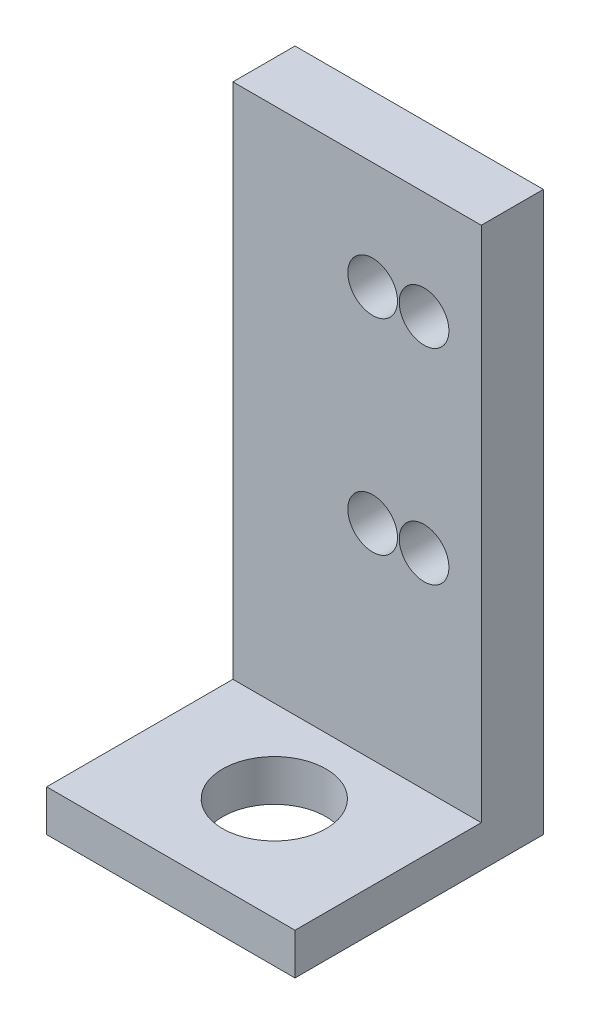
ISO-10303-21;
HEADER;
FILE_DESCRIPTION(('STEP AP214'),'2;1');
FILE_NAME('part.step','',(''),(''),'','','');
FILE_SCHEMA(('AUTOMOTIVE_DESIGN { 1 0 10303 214 1 1 1 1 }'));
ENDSEC;
DATA;
#1=APPLICATION_CONTEXT('core data for automotive mechanical design processes');
#2=APPLICATION_PROTOCOL_DEFINITION('international standard','automotive_design',2000,#1);
#3=PRODUCT_CONTEXT('',#1,'mechanical');
#4=PRODUCT('Part','Part','',(#3));
#5=PRODUCT_RELATED_PRODUCT_CATEGORY('part','',(#4));
#6=PRODUCT_DEFINITION_FORMATION('','',#4);
#7=PRODUCT_DEFINITION_CONTEXT('part definition',#1,'design');
#8=PRODUCT_DEFINITION('design','',#6,#7);
#9=PRODUCT_DEFINITION_SHAPE('','',#8);
#10=(LENGTH_UNIT() NAMED_UNIT(*) SI_UNIT(.MILLI.,.METRE.));
#11=(NAMED_UNIT(*) PLANE_ANGLE_UNIT() SI_UNIT($,.RADIAN.));
#12=(NAMED_UNIT(*) SI_UNIT($,.STERADIAN.) SOLID_ANGLE_UNIT());
#13=UNCERTAINTY_MEASURE_WITH_UNIT(LENGTH_MEASURE(1.E-05),#10,'distance_accuracy_value','');
#14=(GEOMETRIC_REPRESENTATION_CONTEXT(3) GLOBAL_UNCERTAINTY_ASSIGNED_CONTEXT((#13)) GLOBAL_UNIT_ASSIGNED_CONTEXT((#10,
#11,#12)) REPRESENTATION_CONTEXT('',''));
#15=CARTESIAN_POINT('',(0.,0.,0.));
#16=DIRECTION('',(0.,0.,1.));
#17=DIRECTION('',(1.,0.,0.));
#18=AXIS2_PLACEMENT_3D('',#15,#16,#17);
#19=CARTESIAN_POINT('',(0.,0.,3.));
#20=DIRECTION('',(0.,0.,-1.));
#21=DIRECTION('',(-1.,0.,0.));
#22=AXIS2_PLACEMENT_3D('',#19,#20,#21);
#23=PLANE('',#22);
#24=CARTESIAN_POINT('',(6.75218231571925,11.8999999999979,3.));
#25=DIRECTION('',(0.,0.,1.));
#26=DIRECTION('',(1.,0.,0.));
#27=AXIS2_PLACEMENT_3D('',#24,#25,#26);
#28=CIRCLE('',#27,1.2);
#29=CARTESIAN_POINT('',(7.95218231571925,11.8999999999979,3.));
#30=VERTEX_POINT('',#29);
#31=EDGE_CURVE('E137',#30,#30,#28,.T.);
#32=ORIENTED_EDGE('',*,*,#31,.F.);
#33=EDGE_LOOP('',(#32));
#34=FACE_BOUND('',#33,.T.);
#35=CARTESIAN_POINT('',(6.75218231571925,21.7999999999979,3.));
#36=DIRECTION('',(0.,0.,1.));
#37=DIRECTION('',(1.,0.,0.));
#38=AXIS2_PLACEMENT_3D('',#35,#36,#37);
#39=CIRCLE('',#38,1.2);
#40=CARTESIAN_POINT('',(7.95218231571925,21.7999999999979,3.));
#41=VERTEX_POINT('',#40);
#42=EDGE_CURVE('E145',#41,#41,#39,.T.);
#43=ORIENTED_EDGE('',*,*,#42,.F.);
#44=EDGE_LOOP('',(#43));
#45=FACE_BOUND('',#44,.T.);
#46=CARTESIAN_POINT('',(9.23614126060771,11.8999999999912,3.));
#47=DIRECTION('',(0.,0.,1.));
#48=DIRECTION('',(1.,0.,0.));
#49=AXIS2_PLACEMENT_3D('',#46,#47,#48);
#50=CIRCLE('',#49,1.2);
#51=CARTESIAN_POINT('',(10.4361412606077,11.8999999999912,3.));
#52=VERTEX_POINT('',#51);
#53=EDGE_CURVE('E130',#52,#52,#50,.T.);
#54=ORIENTED_EDGE('',*,*,#53,.F.);
#55=EDGE_LOOP('',(#54));
#56=FACE_BOUND('',#55,.T.);
#57=CARTESIAN_POINT('',(9.23614126060771,21.7999999999912,3.));
#58=DIRECTION('',(0.,0.,1.));
#59=DIRECTION('',(1.,0.,0.));
#60=AXIS2_PLACEMENT_3D('',#57,#58,#59);
#61=CIRCLE('',#60,1.2);
#62=CARTESIAN_POINT('',(10.4361412606077,21.7999999999912,3.));
#63=VERTEX_POINT('',#62);
#64=EDGE_CURVE('E143',#63,#63,#61,.T.);
#65=ORIENTED_EDGE('',*,*,#64,.F.);
#66=EDGE_LOOP('',(#65));
#67=FACE_BOUND('',#66,.T.);
#68=DIRECTION('',(-1.,0.,0.));
#69=VECTOR('',#68,1.);
#70=CARTESIAN_POINT('',(0.,2.,3.));
#71=LINE('',#70,#69);
#72=CARTESIAN_POINT('',(12.,2.,3.));
#73=VERTEX_POINT('',#72);
#74=CARTESIAN_POINT('',(0.,2.,3.));
#75=VERTEX_POINT('',#74);
#76=EDGE_CURVE('E58',#73,#75,#71,.T.);
#77=ORIENTED_EDGE('',*,*,#76,.F.);
#78=DIRECTION('',(0.,1.,0.));
#79=VECTOR('',#78,1.);
#80=CARTESIAN_POINT('',(12.,0.,3.));
#81=LINE('',#80,#79);
#82=CARTESIAN_POINT('',(12.,27.,3.));
#83=VERTEX_POINT('',#82);
#84=EDGE_CURVE('E187',#73,#83,#81,.T.);
#85=ORIENTED_EDGE('',*,*,#84,.T.);
#86=DIRECTION('',(-1.,0.,0.));
#87=VECTOR('',#86,1.);
#88=CARTESIAN_POINT('',(0.,27.,3.));
#89=LINE('',#88,#87);
#90=CARTESIAN_POINT('',(0.,27.,3.));
#91=VERTEX_POINT('',#90);
#92=EDGE_CURVE('E64',#83,#91,#89,.T.);
#93=ORIENTED_EDGE('',*,*,#92,.T.);
#94=DIRECTION('',(0.,-1.,0.));
#95=VECTOR('',#94,1.);
#96=CARTESIAN_POINT('',(0.,0.,3.));
#97=LINE('',#96,#95);
#98=EDGE_CURVE('E94',#91,#75,#97,.T.);
#99=ORIENTED_EDGE('',*,*,#98,.T.);
#100=EDGE_LOOP('',(#77,#85,#93,#99));
#101=FACE_BOUND('',#100,.T.);
#102=ADVANCED_FACE('F40',(#34,#45,#56,#67,#101),#23,.F.);
#103=CARTESIAN_POINT('',(0.,0.,3.));
#104=DIRECTION('',(1.,0.,0.));
#105=DIRECTION('',(0.,0.,-1.));
#106=AXIS2_PLACEMENT_3D('',#103,#104,#105);
#107=PLANE('',#106);
#108=DIRECTION('',(0.,-1.,0.));
#109=VECTOR('',#108,1.);
#110=CARTESIAN_POINT('',(0.,0.,0.));
#111=LINE('',#110,#109);
#112=CARTESIAN_POINT('',(0.,27.,0.));
#113=VERTEX_POINT('',#112);
#114=CARTESIAN_POINT('',(0.,0.,0.));
#115=VERTEX_POINT('',#114);
#116=EDGE_CURVE('E100',#113,#115,#111,.T.);
#117=ORIENTED_EDGE('',*,*,#116,.T.);
#118=DIRECTION('',(0.,0.,-1.));
#119=VECTOR('',#118,1.);
#120=CARTESIAN_POINT('',(0.,0.,3.));
#121=LINE('',#120,#119);
#122=CARTESIAN_POINT('',(0.,0.,12.));
#123=VERTEX_POINT('',#122);
#124=EDGE_CURVE('E11',#123,#115,#121,.T.);
#125=ORIENTED_EDGE('',*,*,#124,.F.);
#126=DIRECTION('',(0.,-1.,0.));
#127=VECTOR('',#126,1.);
#128=CARTESIAN_POINT('',(0.,0.,12.));
#129=LINE('',#128,#127);
#130=CARTESIAN_POINT('',(0.,2.,12.));
#131=VERTEX_POINT('',#130);
#132=EDGE_CURVE('E166',#131,#123,#129,.T.);
#133=ORIENTED_EDGE('',*,*,#132,.F.);
#134=DIRECTION('',(0.,0.,-1.));
#135=VECTOR('',#134,1.);
#136=CARTESIAN_POINT('',(0.,2.,12.));
#137=LINE('',#136,#135);
#138=EDGE_CURVE('E113',#131,#75,#137,.T.);
#139=ORIENTED_EDGE('',*,*,#138,.T.);
#140=ORIENTED_EDGE('',*,*,#98,.F.);
#141=DIRECTION('',(0.,0.,-1.));
#142=VECTOR('',#141,1.);
#143=CARTESIAN_POINT('',(0.,27.,3.));
#144=LINE('',#143,#142);
#145=EDGE_CURVE('E86',#91,#113,#144,.T.);
#146=ORIENTED_EDGE('',*,*,#145,.T.);
#147=EDGE_LOOP('',(#117,#125,#133,#139,#140,#146));
#148=FACE_BOUND('',#147,.T.);
#149=ADVANCED_FACE('F42',(#148),#107,.F.);
#150=CARTESIAN_POINT('',(0.,0.,3.));
#151=DIRECTION('',(0.,1.,0.));
#152=DIRECTION('',(0.,0.,1.));
#153=AXIS2_PLACEMENT_3D('',#150,#151,#152);
#154=PLANE('',#153);
#155=CARTESIAN_POINT('',(6.00000000000001,0.,7.00000000000005));
#156=DIRECTION('',(0.,1.,0.));
#157=DIRECTION('',(0.,0.,1.));
#158=AXIS2_PLACEMENT_3D('',#155,#156,#157);
#159=CIRCLE('',#158,2.5);
#160=CARTESIAN_POINT('',(6.00000000000001,0.,9.50000000000005));
#161=VERTEX_POINT('',#160);
#162=EDGE_CURVE('E162',#161,#161,#159,.T.);
#163=ORIENTED_EDGE('',*,*,#162,.T.);
#164=EDGE_LOOP('',(#163));
#165=FACE_BOUND('',#164,.T.);
#166=DIRECTION('',(1.,0.,0.));
#167=VECTOR('',#166,1.);
#168=CARTESIAN_POINT('',(0.,0.,0.));
#169=LINE('',#168,#167);
#170=CARTESIAN_POINT('',(12.,0.,0.));
#171=VERTEX_POINT('',#170);
#172=EDGE_CURVE('E105',#115,#171,#169,.T.);
#173=ORIENTED_EDGE('',*,*,#172,.T.);
#174=DIRECTION('',(0.,0.,-1.));
#175=VECTOR('',#174,1.);
#176=CARTESIAN_POINT('',(12.,0.,3.));
#177=LINE('',#176,#175);
#178=CARTESIAN_POINT('',(12.,0.,12.));
#179=VERTEX_POINT('',#178);
#180=EDGE_CURVE('E50',#179,#171,#177,.T.);
#181=ORIENTED_EDGE('',*,*,#180,.F.);
#182=DIRECTION('',(1.,0.,0.));
#183=VECTOR('',#182,1.);
#184=CARTESIAN_POINT('',(0.,0.,12.));
#185=LINE('',#184,#183);
#186=EDGE_CURVE('E170',#123,#179,#185,.T.);
#187=ORIENTED_EDGE('',*,*,#186,.F.);
#188=ORIENTED_EDGE('',*,*,#124,.T.);
#189=EDGE_LOOP('',(#173,#181,#187,#188));
#190=FACE_BOUND('',#189,.T.);
#191=ADVANCED_FACE('F198',(#165,#190),#154,.F.);
#192=CARTESIAN_POINT('',(12.,0.,3.));
#193=DIRECTION('',(-1.,0.,0.));
#194=DIRECTION('',(0.,0.,1.));
#195=AXIS2_PLACEMENT_3D('',#192,#193,#194);
#196=PLANE('',#195);
#197=DIRECTION('',(0.,1.,0.));
#198=VECTOR('',#197,1.);
#199=CARTESIAN_POINT('',(12.,0.,0.));
#200=LINE('',#199,#198);
#201=CARTESIAN_POINT('',(12.,27.,0.));
#202=VERTEX_POINT('',#201);
#203=EDGE_CURVE('E95',#171,#202,#200,.T.);
#204=ORIENTED_EDGE('',*,*,#203,.T.);
#205=DIRECTION('',(0.,0.,-1.));
#206=VECTOR('',#205,1.);
#207=CARTESIAN_POINT('',(12.,27.,3.));
#208=LINE('',#207,#206);
#209=EDGE_CURVE('E89',#83,#202,#208,.T.);
#210=ORIENTED_EDGE('',*,*,#209,.F.);
#211=ORIENTED_EDGE('',*,*,#84,.F.);
#212=DIRECTION('',(0.,0.,-1.));
#213=VECTOR('',#212,1.);
#214=CARTESIAN_POINT('',(12.,2.,12.));
#215=LINE('',#214,#213);
#216=CARTESIAN_POINT('',(12.,2.,12.));
#217=VERTEX_POINT('',#216);
#218=EDGE_CURVE('E107',#217,#73,#215,.T.);
#219=ORIENTED_EDGE('',*,*,#218,.F.);
#220=DIRECTION('',(0.,1.,0.));
#221=VECTOR('',#220,1.);
#222=CARTESIAN_POINT('',(12.,0.,12.));
#223=LINE('',#222,#221);
#224=EDGE_CURVE('E174',#179,#217,#223,.T.);
#225=ORIENTED_EDGE('',*,*,#224,.F.);
#226=ORIENTED_EDGE('',*,*,#180,.T.);
#227=EDGE_LOOP('',(#204,#210,#211,#219,#225,#226));
#228=FACE_BOUND('',#227,.T.);
#229=ADVANCED_FACE('F192',(#228),#196,.F.);
#230=CARTESIAN_POINT('',(0.,27.,3.));
#231=DIRECTION('',(0.,-1.,0.));
#232=DIRECTION('',(0.,0.,-1.));
#233=AXIS2_PLACEMENT_3D('',#230,#231,#232);
#234=PLANE('',#233);
#235=DIRECTION('',(-1.,0.,0.));
#236=VECTOR('',#235,1.);
#237=CARTESIAN_POINT('',(0.,27.,0.));
#238=LINE('',#237,#236);
#239=EDGE_CURVE('E83',#202,#113,#238,.T.);
#240=ORIENTED_EDGE('',*,*,#239,.T.);
#241=ORIENTED_EDGE('',*,*,#145,.F.);
#242=ORIENTED_EDGE('',*,*,#92,.F.);
#243=ORIENTED_EDGE('',*,*,#209,.T.);
#244=EDGE_LOOP('',(#240,#241,#242,#243));
#245=FACE_BOUND('',#244,.T.);
#246=ADVANCED_FACE('F85',(#245),#234,.F.);
#247=CARTESIAN_POINT('',(0.,0.,0.));
#248=DIRECTION('',(0.,0.,-1.));
#249=DIRECTION('',(-1.,0.,0.));
#250=AXIS2_PLACEMENT_3D('',#247,#248,#249);
#251=PLANE('',#250);
#252=CARTESIAN_POINT('',(6.75218231571925,11.8999999999979,0.));
#253=DIRECTION('',(0.,0.,-1.));
#254=DIRECTION('',(-1.,0.,0.));
#255=AXIS2_PLACEMENT_3D('',#252,#253,#254);
#256=CIRCLE('',#255,1.2);
#257=CARTESIAN_POINT('',(5.55218231571925,11.8999999999979,0.));
#258=VERTEX_POINT('',#257);
#259=EDGE_CURVE('E44',#258,#258,#256,.T.);
#260=ORIENTED_EDGE('',*,*,#259,.F.);
#261=EDGE_LOOP('',(#260));
#262=FACE_BOUND('',#261,.T.);
#263=CARTESIAN_POINT('',(6.75218231571925,21.7999999999979,0.));
#264=DIRECTION('',(0.,0.,-1.));
#265=DIRECTION('',(-1.,0.,0.));
#266=AXIS2_PLACEMENT_3D('',#263,#264,#265);
#267=CIRCLE('',#266,1.2);
#268=CARTESIAN_POINT('',(5.55218231571925,21.7999999999979,0.));
#269=VERTEX_POINT('',#268);
#270=EDGE_CURVE('E134',#269,#269,#267,.T.);
#271=ORIENTED_EDGE('',*,*,#270,.F.);
#272=EDGE_LOOP('',(#271));
#273=FACE_BOUND('',#272,.T.);
#274=CARTESIAN_POINT('',(9.23614126060771,11.8999999999912,0.));
#275=DIRECTION('',(0.,0.,-1.));
#276=DIRECTION('',(-1.,0.,0.));
#277=AXIS2_PLACEMENT_3D('',#274,#275,#276);
#278=CIRCLE('',#277,1.2);
#279=CARTESIAN_POINT('',(8.03614126060772,11.8999999999912,0.));
#280=VERTEX_POINT('',#279);
#281=EDGE_CURVE('E129',#280,#280,#278,.T.);
#282=ORIENTED_EDGE('',*,*,#281,.F.);
#283=EDGE_LOOP('',(#282));
#284=FACE_BOUND('',#283,.T.);
#285=CARTESIAN_POINT('',(9.23614126060771,21.7999999999912,0.));
#286=DIRECTION('',(0.,0.,-1.));
#287=DIRECTION('',(-1.,0.,0.));
#288=AXIS2_PLACEMENT_3D('',#285,#286,#287);
#289=CIRCLE('',#288,1.2);
#290=CARTESIAN_POINT('',(8.03614126060772,21.7999999999912,0.));
#291=VERTEX_POINT('',#290);
#292=EDGE_CURVE('E125',#291,#291,#289,.T.);
#293=ORIENTED_EDGE('',*,*,#292,.F.);
#294=EDGE_LOOP('',(#293));
#295=FACE_BOUND('',#294,.T.);
#296=ORIENTED_EDGE('',*,*,#116,.F.);
#297=ORIENTED_EDGE('',*,*,#239,.F.);
#298=ORIENTED_EDGE('',*,*,#203,.F.);
#299=ORIENTED_EDGE('',*,*,#172,.F.);
#300=EDGE_LOOP('',(#296,#297,#298,#299));
#301=FACE_BOUND('',#300,.T.);
#302=ADVANCED_FACE('F104',(#262,#273,#284,#295,#301),#251,.T.);
#303=CARTESIAN_POINT('',(0.,2.,12.));
#304=DIRECTION('',(0.,-1.,0.));
#305=DIRECTION('',(0.,0.,-1.));
#306=AXIS2_PLACEMENT_3D('',#303,#304,#305);
#307=PLANE('',#306);
#308=CARTESIAN_POINT('',(6.00000000000001,2.,7.00000000000005));
#309=DIRECTION('',(0.,1.,0.));
#310=DIRECTION('',(0.,0.,1.));
#311=AXIS2_PLACEMENT_3D('',#308,#309,#310);
#312=CIRCLE('',#311,2.5);
#313=CARTESIAN_POINT('',(6.00000000000001,2.,9.50000000000005));
#314=VERTEX_POINT('',#313);
#315=EDGE_CURVE('E133',#314,#314,#312,.T.);
#316=ORIENTED_EDGE('',*,*,#315,.F.);
#317=EDGE_LOOP('',(#316));
#318=FACE_BOUND('',#317,.T.);
#319=ORIENTED_EDGE('',*,*,#76,.T.);
#320=ORIENTED_EDGE('',*,*,#138,.F.);
#321=DIRECTION('',(-1.,0.,0.));
#322=VECTOR('',#321,1.);
#323=CARTESIAN_POINT('',(0.,2.,12.));
#324=LINE('',#323,#322);
#325=EDGE_CURVE('E178',#217,#131,#324,.T.);
#326=ORIENTED_EDGE('',*,*,#325,.F.);
#327=ORIENTED_EDGE('',*,*,#218,.T.);
#328=EDGE_LOOP('',(#319,#320,#326,#327));
#329=FACE_BOUND('',#328,.T.);
#330=ADVANCED_FACE('F212',(#318,#329),#307,.F.);
#331=CARTESIAN_POINT('',(0.,0.,12.));
#332=DIRECTION('',(0.,0.,-1.));
#333=DIRECTION('',(-1.,0.,0.));
#334=AXIS2_PLACEMENT_3D('',#331,#332,#333);
#335=PLANE('',#334);
#336=ORIENTED_EDGE('',*,*,#132,.T.);
#337=ORIENTED_EDGE('',*,*,#186,.T.);
#338=ORIENTED_EDGE('',*,*,#224,.T.);
#339=ORIENTED_EDGE('',*,*,#325,.T.);
#340=EDGE_LOOP('',(#336,#337,#338,#339));
#341=FACE_BOUND('',#340,.T.);
#342=ADVANCED_FACE('F203',(#341),#335,.F.);
#343=CARTESIAN_POINT('',(6.00000000000001,-8.,7.00000000000005));
#344=DIRECTION('',(0.,1.,0.));
#345=DIRECTION('',(0.,0.,1.));
#346=AXIS2_PLACEMENT_3D('',#343,#344,#345);
#347=CYLINDRICAL_SURFACE('',#346,2.5);
#348=ORIENTED_EDGE('',*,*,#315,.T.);
#349=EDGE_LOOP('',(#348));
#350=FACE_BOUND('',#349,.T.);
#351=ORIENTED_EDGE('',*,*,#162,.F.);
#352=EDGE_LOOP('',(#351));
#353=FACE_BOUND('',#352,.T.);
#354=ADVANCED_FACE('F220',(#350,#353),#347,.F.);
#355=CARTESIAN_POINT('',(9.23614126060771,21.7999999999912,-7.));
#356=DIRECTION('',(0.,0.,1.));
#357=DIRECTION('',(1.,0.,0.));
#358=AXIS2_PLACEMENT_3D('',#355,#356,#357);
#359=CYLINDRICAL_SURFACE('',#358,1.2);
#360=ORIENTED_EDGE('',*,*,#292,.T.);
#361=EDGE_LOOP('',(#360));
#362=FACE_BOUND('',#361,.T.);
#363=ORIENTED_EDGE('',*,*,#64,.T.);
#364=EDGE_LOOP('',(#363));
#365=FACE_BOUND('',#364,.T.);
#366=ADVANCED_FACE('F243',(#362,#365),#359,.F.);
#367=CARTESIAN_POINT('',(9.23614126060771,11.8999999999912,-7.));
#368=DIRECTION('',(0.,0.,1.));
#369=DIRECTION('',(1.,0.,0.));
#370=AXIS2_PLACEMENT_3D('',#367,#368,#369);
#371=CYLINDRICAL_SURFACE('',#370,1.2);
#372=ORIENTED_EDGE('',*,*,#281,.T.);
#373=EDGE_LOOP('',(#372));
#374=FACE_BOUND('',#373,.T.);
#375=ORIENTED_EDGE('',*,*,#53,.T.);
#376=EDGE_LOOP('',(#375));
#377=FACE_BOUND('',#376,.T.);
#378=ADVANCED_FACE('F249',(#374,#377),#371,.F.);
#379=CARTESIAN_POINT('',(6.75218231571925,21.7999999999979,-7.));
#380=DIRECTION('',(0.,0.,1.));
#381=DIRECTION('',(1.,0.,0.));
#382=AXIS2_PLACEMENT_3D('',#379,#380,#381);
#383=CYLINDRICAL_SURFACE('',#382,1.2);
#384=ORIENTED_EDGE('',*,*,#270,.T.);
#385=EDGE_LOOP('',(#384));
#386=FACE_BOUND('',#385,.T.);
#387=ORIENTED_EDGE('',*,*,#42,.T.);
#388=EDGE_LOOP('',(#387));
#389=FACE_BOUND('',#388,.T.);
#390=ADVANCED_FACE('F255',(#386,#389),#383,.F.);
#391=CARTESIAN_POINT('',(6.75218231571925,11.8999999999979,-7.));
#392=DIRECTION('',(0.,0.,1.));
#393=DIRECTION('',(1.,0.,0.));
#394=AXIS2_PLACEMENT_3D('',#391,#392,#393);
#395=CYLINDRICAL_SURFACE('',#394,1.2);
#396=ORIENTED_EDGE('',*,*,#259,.T.);
#397=EDGE_LOOP('',(#396));
#398=FACE_BOUND('',#397,.T.);
#399=ORIENTED_EDGE('',*,*,#31,.T.);
#400=EDGE_LOOP('',(#399));
#401=FACE_BOUND('',#400,.T.);
#402=ADVANCED_FACE('F259',(#398,#401),#395,.F.);
#403=CLOSED_SHELL('',(#102,#149,#191,#229,#246,#302,#330,#342,#354,#366,#378,#390,#402));
#404=MANIFOLD_SOLID_BREP('B2',#403);
#405=ADVANCED_BREP_SHAPE_REPRESENTATION('',(#18,#404),#14);
#406=SHAPE_DEFINITION_REPRESENTATION(#9,#405);
ENDSEC;
END-ISO-10303-21;
